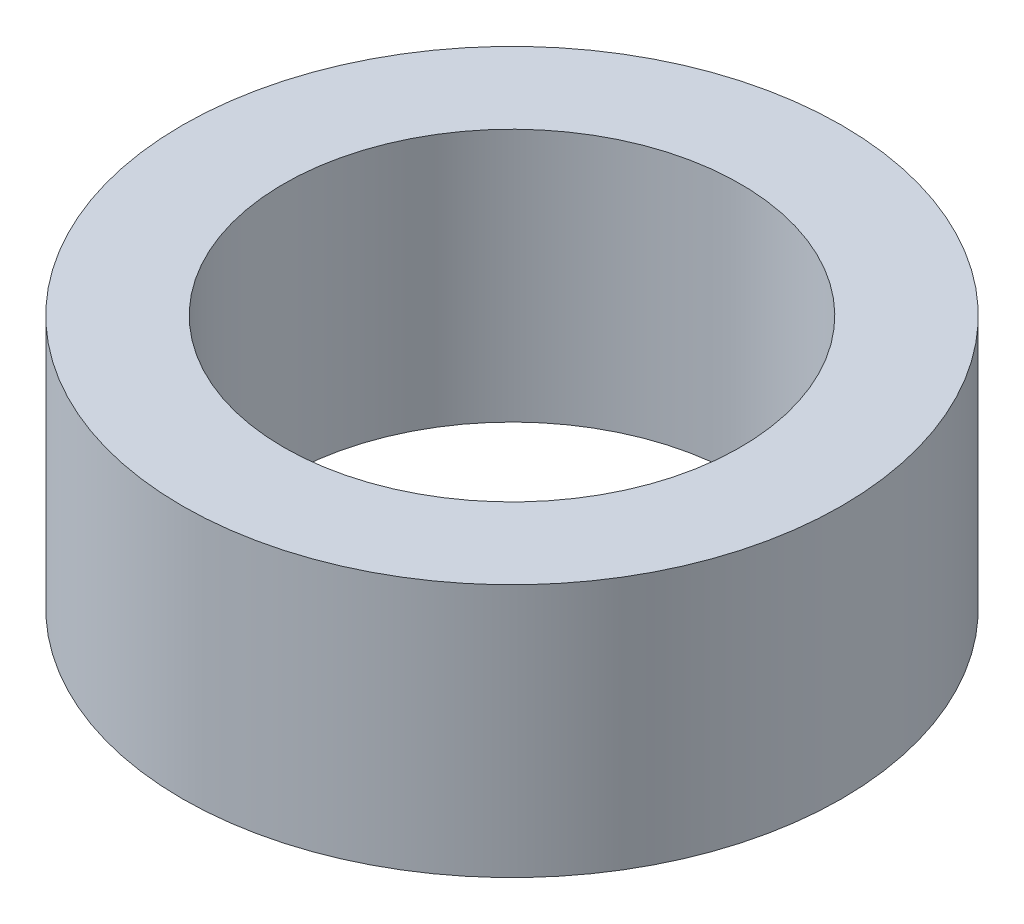
ISO-10303-21;
HEADER;
FILE_DESCRIPTION(('STEP AP214'),'2;1');
FILE_NAME('part.step','',(''),(''),'','','');
FILE_SCHEMA(('AUTOMOTIVE_DESIGN { 1 0 10303 214 1 1 1 1 }'));
ENDSEC;
DATA;
#1=APPLICATION_CONTEXT('core data for automotive mechanical design processes');
#2=APPLICATION_PROTOCOL_DEFINITION('international standard','automotive_design',2000,#1);
#3=PRODUCT_CONTEXT('',#1,'mechanical');
#4=PRODUCT('Part','Part','',(#3));
#5=PRODUCT_RELATED_PRODUCT_CATEGORY('part','',(#4));
#6=PRODUCT_DEFINITION_FORMATION('','',#4);
#7=PRODUCT_DEFINITION_CONTEXT('part definition',#1,'design');
#8=PRODUCT_DEFINITION('design','',#6,#7);
#9=PRODUCT_DEFINITION_SHAPE('','',#8);
#10=(LENGTH_UNIT() NAMED_UNIT(*) SI_UNIT(.MILLI.,.METRE.));
#11=(NAMED_UNIT(*) PLANE_ANGLE_UNIT() SI_UNIT($,.RADIAN.));
#12=(NAMED_UNIT(*) SI_UNIT($,.STERADIAN.) SOLID_ANGLE_UNIT());
#13=UNCERTAINTY_MEASURE_WITH_UNIT(LENGTH_MEASURE(1.E-05),#10,'distance_accuracy_value','');
#14=(GEOMETRIC_REPRESENTATION_CONTEXT(3) GLOBAL_UNCERTAINTY_ASSIGNED_CONTEXT((#13)) GLOBAL_UNIT_ASSIGNED_CONTEXT((#10,
#11,#12)) REPRESENTATION_CONTEXT('',''));
#15=CARTESIAN_POINT('',(0.,0.,0.));
#16=DIRECTION('',(0.,0.,1.));
#17=DIRECTION('',(1.,0.,0.));
#18=AXIS2_PLACEMENT_3D('',#15,#16,#17);
#19=CARTESIAN_POINT('',(0.,2.,0.));
#20=DIRECTION('',(0.,1.,0.));
#21=DIRECTION('',(0.,0.,1.));
#22=AXIS2_PLACEMENT_3D('',#19,#20,#21);
#23=PLANE('',#22);
#24=CARTESIAN_POINT('',(0.,2.,0.));
#25=DIRECTION('',(0.,1.,0.));
#26=DIRECTION('',(0.,0.,1.));
#27=AXIS2_PLACEMENT_3D('',#24,#25,#26);
#28=CIRCLE('',#27,2.6);
#29=CARTESIAN_POINT('',(0.,2.,2.6));
#30=VERTEX_POINT('',#29);
#31=EDGE_CURVE('E10',#30,#30,#28,.T.);
#32=ORIENTED_EDGE('',*,*,#31,.T.);
#33=EDGE_LOOP('',(#32));
#34=FACE_BOUND('',#33,.T.);
#35=CARTESIAN_POINT('',(0.,2.,0.));
#36=DIRECTION('',(0.,1.,0.));
#37=DIRECTION('',(0.,0.,1.));
#38=AXIS2_PLACEMENT_3D('',#35,#36,#37);
#39=CIRCLE('',#38,1.8);
#40=CARTESIAN_POINT('',(0.,2.,1.8));
#41=VERTEX_POINT('',#40);
#42=EDGE_CURVE('E50',#41,#41,#39,.T.);
#43=ORIENTED_EDGE('',*,*,#42,.F.);
#44=EDGE_LOOP('',(#43));
#45=FACE_BOUND('',#44,.T.);
#46=ADVANCED_FACE('F37',(#34,#45),#23,.T.);
#47=CARTESIAN_POINT('',(0.,0.,0.));
#48=DIRECTION('',(0.,1.,0.));
#49=DIRECTION('',(0.,0.,1.));
#50=AXIS2_PLACEMENT_3D('',#47,#48,#49);
#51=PLANE('',#50);
#52=CARTESIAN_POINT('',(0.,0.,0.));
#53=DIRECTION('',(0.,1.,0.));
#54=DIRECTION('',(0.,0.,1.));
#55=AXIS2_PLACEMENT_3D('',#52,#53,#54);
#56=CIRCLE('',#55,2.6);
#57=CARTESIAN_POINT('',(0.,0.,2.6));
#58=VERTEX_POINT('',#57);
#59=EDGE_CURVE('E41',#58,#58,#56,.T.);
#60=ORIENTED_EDGE('',*,*,#59,.F.);
#61=EDGE_LOOP('',(#60));
#62=FACE_BOUND('',#61,.T.);
#63=CARTESIAN_POINT('',(0.,0.,0.));
#64=DIRECTION('',(0.,1.,0.));
#65=DIRECTION('',(0.,0.,1.));
#66=AXIS2_PLACEMENT_3D('',#63,#64,#65);
#67=CIRCLE('',#66,1.8);
#68=CARTESIAN_POINT('',(0.,0.,1.8));
#69=VERTEX_POINT('',#68);
#70=EDGE_CURVE('E52',#69,#69,#67,.T.);
#71=ORIENTED_EDGE('',*,*,#70,.T.);
#72=EDGE_LOOP('',(#71));
#73=FACE_BOUND('',#72,.T.);
#74=ADVANCED_FACE('F64',(#62,#73),#51,.F.);
#75=CARTESIAN_POINT('',(0.,2.,0.));
#76=DIRECTION('',(0.,-1.,0.));
#77=DIRECTION('',(0.,0.,-1.));
#78=AXIS2_PLACEMENT_3D('',#75,#76,#77);
#79=CYLINDRICAL_SURFACE('',#78,2.6);
#80=ORIENTED_EDGE('',*,*,#31,.F.);
#81=EDGE_LOOP('',(#80));
#82=FACE_BOUND('',#81,.T.);
#83=ORIENTED_EDGE('',*,*,#59,.T.);
#84=EDGE_LOOP('',(#83));
#85=FACE_BOUND('',#84,.T.);
#86=ADVANCED_FACE('F39',(#82,#85),#79,.T.);
#87=CARTESIAN_POINT('',(0.,2.,0.));
#88=DIRECTION('',(0.,-1.,0.));
#89=DIRECTION('',(0.,0.,-1.));
#90=AXIS2_PLACEMENT_3D('',#87,#88,#89);
#91=CYLINDRICAL_SURFACE('',#90,1.8);
#92=ORIENTED_EDGE('',*,*,#42,.T.);
#93=EDGE_LOOP('',(#92));
#94=FACE_BOUND('',#93,.T.);
#95=ORIENTED_EDGE('',*,*,#70,.F.);
#96=EDGE_LOOP('',(#95));
#97=FACE_BOUND('',#96,.T.);
#98=ADVANCED_FACE('F60',(#94,#97),#91,.F.);
#99=CLOSED_SHELL('',(#46,#74,#86,#98));
#100=MANIFOLD_SOLID_BREP('B2',#99);
#101=ADVANCED_BREP_SHAPE_REPRESENTATION('',(#18,#100),#14);
#102=SHAPE_DEFINITION_REPRESENTATION(#9,#101);
ENDSEC;
END-ISO-10303-21;
